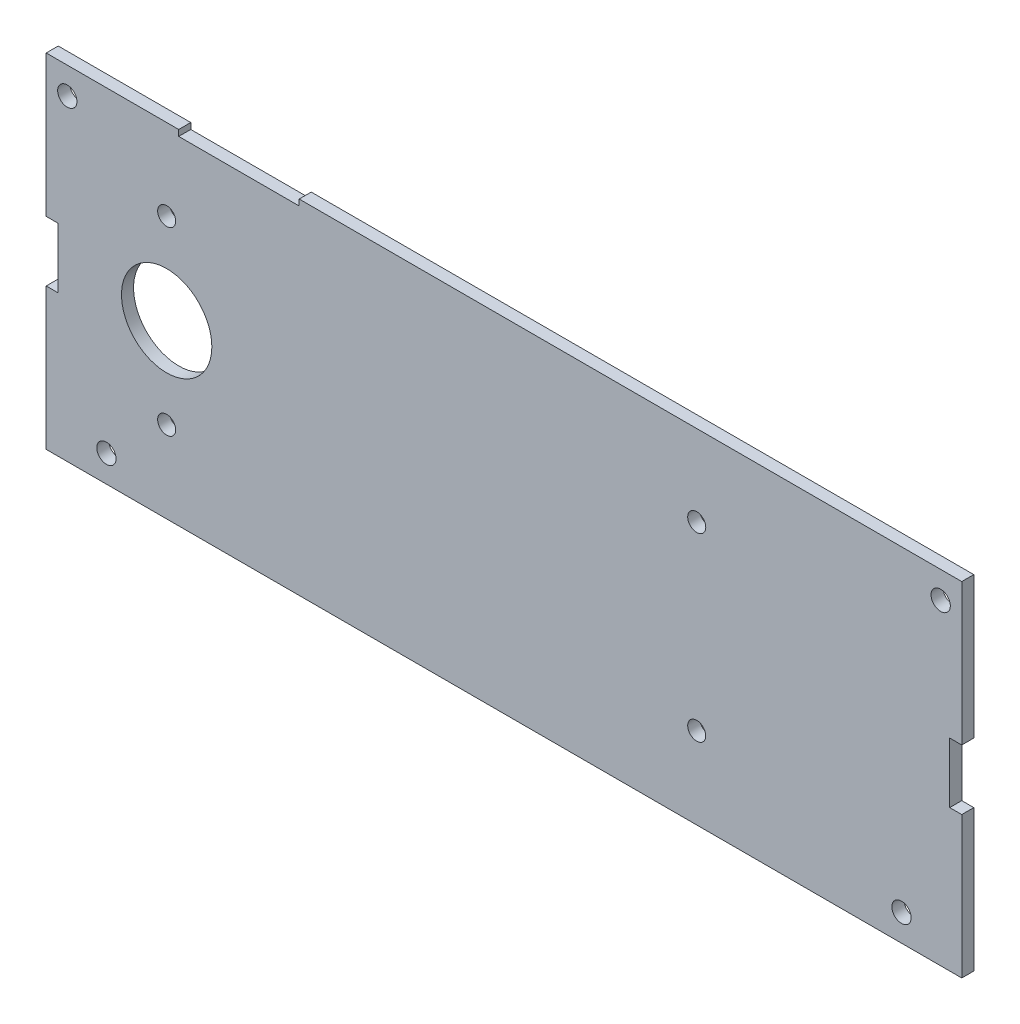
ISO-10303-21;
HEADER;
FILE_DESCRIPTION(('STEP AP214'),'2;1');
FILE_NAME('part.step','',(''),(''),'','','');
FILE_SCHEMA(('AUTOMOTIVE_DESIGN { 1 0 10303 214 1 1 1 1 }'));
ENDSEC;
DATA;
#1=APPLICATION_CONTEXT('core data for automotive mechanical design processes');
#2=APPLICATION_PROTOCOL_DEFINITION('international standard','automotive_design',2000,#1);
#3=PRODUCT_CONTEXT('',#1,'mechanical');
#4=PRODUCT('Part','Part','',(#3));
#5=PRODUCT_RELATED_PRODUCT_CATEGORY('part','',(#4));
#6=PRODUCT_DEFINITION_FORMATION('','',#4);
#7=PRODUCT_DEFINITION_CONTEXT('part definition',#1,'design');
#8=PRODUCT_DEFINITION('design','',#6,#7);
#9=PRODUCT_DEFINITION_SHAPE('','',#8);
#10=(LENGTH_UNIT() NAMED_UNIT(*) SI_UNIT(.MILLI.,.METRE.));
#11=(NAMED_UNIT(*) PLANE_ANGLE_UNIT() SI_UNIT($,.RADIAN.));
#12=(NAMED_UNIT(*) SI_UNIT($,.STERADIAN.) SOLID_ANGLE_UNIT());
#13=UNCERTAINTY_MEASURE_WITH_UNIT(LENGTH_MEASURE(1.E-05),#10,'distance_accuracy_value','');
#14=(GEOMETRIC_REPRESENTATION_CONTEXT(3) GLOBAL_UNCERTAINTY_ASSIGNED_CONTEXT((#13)) GLOBAL_UNIT_ASSIGNED_CONTEXT((#10,
#11,#12)) REPRESENTATION_CONTEXT('',''));
#15=CARTESIAN_POINT('',(0.,0.,0.));
#16=DIRECTION('',(0.,0.,1.));
#17=DIRECTION('',(1.,0.,0.));
#18=AXIS2_PLACEMENT_3D('',#15,#16,#17);
#19=CARTESIAN_POINT('',(0.,28.5,2.));
#20=DIRECTION('',(0.,1.,0.));
#21=DIRECTION('',(0.,0.,1.));
#22=AXIS2_PLACEMENT_3D('',#19,#20,#21);
#23=PLANE('',#22);
#24=DIRECTION('',(1.,0.,0.));
#25=VECTOR('',#24,1.);
#26=CARTESIAN_POINT('',(0.,28.5,0.));
#27=LINE('',#26,#25);
#28=CARTESIAN_POINT('',(-34.,28.5,0.));
#29=VERTEX_POINT('',#28);
#30=CARTESIAN_POINT('',(76.,28.5,0.));
#31=VERTEX_POINT('',#30);
#32=EDGE_CURVE('E334',#29,#31,#27,.T.);
#33=ORIENTED_EDGE('',*,*,#32,.F.);
#34=DIRECTION('',(0.,0.,1.));
#35=VECTOR('',#34,1.);
#36=CARTESIAN_POINT('',(-34.,28.5,0.));
#37=LINE('',#36,#35);
#38=CARTESIAN_POINT('',(-34.,28.5,2.));
#39=VERTEX_POINT('',#38);
#40=EDGE_CURVE('E50',#29,#39,#37,.T.);
#41=ORIENTED_EDGE('',*,*,#40,.T.);
#42=DIRECTION('',(1.,0.,0.));
#43=VECTOR('',#42,1.);
#44=CARTESIAN_POINT('',(0.,28.5,2.));
#45=LINE('',#44,#43);
#46=CARTESIAN_POINT('',(76.,28.5,2.));
#47=VERTEX_POINT('',#46);
#48=EDGE_CURVE('E167',#39,#47,#45,.T.);
#49=ORIENTED_EDGE('',*,*,#48,.T.);
#50=DIRECTION('',(0.,0.,-1.));
#51=VECTOR('',#50,1.);
#52=CARTESIAN_POINT('',(76.,28.5,2.));
#53=LINE('',#52,#51);
#54=EDGE_CURVE('E294',#47,#31,#53,.T.);
#55=ORIENTED_EDGE('',*,*,#54,.T.);
#56=EDGE_LOOP('',(#33,#41,#49,#55));
#57=FACE_BOUND('',#56,.T.);
#58=ADVANCED_FACE('F35',(#57),#23,.T.);
#59=CARTESIAN_POINT('',(0.,0.,2.));
#60=DIRECTION('',(0.,0.,1.));
#61=DIRECTION('',(1.,0.,0.));
#62=AXIS2_PLACEMENT_3D('',#59,#60,#61);
#63=PLANE('',#62);
#64=CARTESIAN_POINT('',(32.,15.05,2.));
#65=DIRECTION('',(0.,0.,1.));
#66=DIRECTION('',(1.,0.,0.));
#67=AXIS2_PLACEMENT_3D('',#64,#65,#66);
#68=CIRCLE('',#67,1.5);
#69=CARTESIAN_POINT('',(33.5,15.05,2.));
#70=VERTEX_POINT('',#69);
#71=EDGE_CURVE('E255',#70,#70,#68,.T.);
#72=ORIENTED_EDGE('',*,*,#71,.F.);
#73=EDGE_LOOP('',(#72));
#74=FACE_BOUND('',#73,.T.);
#75=CARTESIAN_POINT('',(-56.,-14.95,2.));
#76=DIRECTION('',(0.,0.,1.));
#77=DIRECTION('',(1.,0.,0.));
#78=AXIS2_PLACEMENT_3D('',#75,#76,#77);
#79=CIRCLE('',#78,1.5);
#80=CARTESIAN_POINT('',(-54.5,-14.95,2.));
#81=VERTEX_POINT('',#80);
#82=EDGE_CURVE('E252',#81,#81,#79,.T.);
#83=ORIENTED_EDGE('',*,*,#82,.F.);
#84=EDGE_LOOP('',(#83));
#85=FACE_BOUND('',#84,.T.);
#86=CARTESIAN_POINT('',(-56.,0.,2.));
#87=DIRECTION('',(0.,0.,1.));
#88=DIRECTION('',(1.,0.,0.));
#89=AXIS2_PLACEMENT_3D('',#86,#87,#88);
#90=CIRCLE('',#89,7.5);
#91=CARTESIAN_POINT('',(-48.5,0.,2.));
#92=VERTEX_POINT('',#91);
#93=EDGE_CURVE('E179',#92,#92,#90,.T.);
#94=ORIENTED_EDGE('',*,*,#93,.F.);
#95=EDGE_LOOP('',(#94));
#96=FACE_BOUND('',#95,.T.);
#97=CARTESIAN_POINT('',(-66.,-24.05,2.));
#98=DIRECTION('',(0.,0.,1.));
#99=DIRECTION('',(1.,0.,0.));
#100=AXIS2_PLACEMENT_3D('',#97,#98,#99);
#101=CIRCLE('',#100,1.6);
#102=CARTESIAN_POINT('',(-64.4,-24.05,2.));
#103=VERTEX_POINT('',#102);
#104=EDGE_CURVE('E214',#103,#103,#101,.T.);
#105=ORIENTED_EDGE('',*,*,#104,.F.);
#106=EDGE_LOOP('',(#105));
#107=FACE_BOUND('',#106,.T.);
#108=CARTESIAN_POINT('',(66.,-24.05,2.));
#109=DIRECTION('',(0.,0.,1.));
#110=DIRECTION('',(1.,0.,0.));
#111=AXIS2_PLACEMENT_3D('',#108,#109,#110);
#112=CIRCLE('',#111,1.6);
#113=CARTESIAN_POINT('',(67.6,-24.05,2.));
#114=VERTEX_POINT('',#113);
#115=EDGE_CURVE('E208',#114,#114,#112,.T.);
#116=ORIENTED_EDGE('',*,*,#115,.F.);
#117=EDGE_LOOP('',(#116));
#118=FACE_BOUND('',#117,.T.);
#119=CARTESIAN_POINT('',(72.5,24.05,2.));
#120=DIRECTION('',(0.,0.,1.));
#121=DIRECTION('',(1.,0.,0.));
#122=AXIS2_PLACEMENT_3D('',#119,#120,#121);
#123=CIRCLE('',#122,1.6);
#124=CARTESIAN_POINT('',(74.1,24.05,2.));
#125=VERTEX_POINT('',#124);
#126=EDGE_CURVE('E202',#125,#125,#123,.T.);
#127=ORIENTED_EDGE('',*,*,#126,.F.);
#128=EDGE_LOOP('',(#127));
#129=FACE_BOUND('',#128,.T.);
#130=CARTESIAN_POINT('',(-72.5,24.05,2.));
#131=DIRECTION('',(0.,0.,1.));
#132=DIRECTION('',(1.,0.,0.));
#133=AXIS2_PLACEMENT_3D('',#130,#131,#132);
#134=CIRCLE('',#133,1.6);
#135=CARTESIAN_POINT('',(-70.9,24.05,2.));
#136=VERTEX_POINT('',#135);
#137=EDGE_CURVE('E192',#136,#136,#134,.T.);
#138=ORIENTED_EDGE('',*,*,#137,.F.);
#139=EDGE_LOOP('',(#138));
#140=FACE_BOUND('',#139,.T.);
#141=CARTESIAN_POINT('',(32.,-14.95,2.));
#142=DIRECTION('',(0.,0.,1.));
#143=DIRECTION('',(1.,0.,0.));
#144=AXIS2_PLACEMENT_3D('',#141,#142,#143);
#145=CIRCLE('',#144,1.5);
#146=CARTESIAN_POINT('',(33.5,-14.95,2.));
#147=VERTEX_POINT('',#146);
#148=EDGE_CURVE('E247',#147,#147,#145,.F.);
#149=ORIENTED_EDGE('',*,*,#148,.T.);
#150=EDGE_LOOP('',(#149));
#151=FACE_BOUND('',#150,.T.);
#152=CARTESIAN_POINT('',(-56.,15.05,2.));
#153=DIRECTION('',(0.,0.,1.));
#154=DIRECTION('',(1.,0.,0.));
#155=AXIS2_PLACEMENT_3D('',#152,#153,#154);
#156=CIRCLE('',#155,1.5);
#157=CARTESIAN_POINT('',(-54.5,15.05,2.));
#158=VERTEX_POINT('',#157);
#159=EDGE_CURVE('E250',#158,#158,#156,.F.);
#160=ORIENTED_EDGE('',*,*,#159,.T.);
#161=EDGE_LOOP('',(#160));
#162=FACE_BOUND('',#161,.T.);
#163=DIRECTION('',(0.,-1.,0.));
#164=VECTOR('',#163,1.);
#165=CARTESIAN_POINT('',(-53.9999999999998,-3.74700270810989E-13,2.));
#166=LINE('',#165,#164);
#167=CARTESIAN_POINT('',(-54.,28.5,2.));
#168=VERTEX_POINT('',#167);
#169=CARTESIAN_POINT('',(-54.,27.5,2.));
#170=VERTEX_POINT('',#169);
#171=EDGE_CURVE('E266',#168,#170,#166,.T.);
#172=ORIENTED_EDGE('',*,*,#171,.F.);
#173=CARTESIAN_POINT('',(-76.,28.5,2.));
#174=VERTEX_POINT('',#173);
#175=EDGE_CURVE('E172',#174,#168,#45,.T.);
#176=ORIENTED_EDGE('',*,*,#175,.F.);
#177=DIRECTION('',(0.,-1.,0.));
#178=VECTOR('',#177,1.);
#179=CARTESIAN_POINT('',(-76.,0.,2.));
#180=LINE('',#179,#178);
#181=CARTESIAN_POINT('',(-76.,5.,2.));
#182=VERTEX_POINT('',#181);
#183=EDGE_CURVE('E350',#174,#182,#180,.T.);
#184=ORIENTED_EDGE('',*,*,#183,.T.);
#185=DIRECTION('',(-1.,0.,0.));
#186=VECTOR('',#185,1.);
#187=CARTESIAN_POINT('',(0.,5.00000000000001,2.));
#188=LINE('',#187,#186);
#189=CARTESIAN_POINT('',(-74.,5.,2.));
#190=VERTEX_POINT('',#189);
#191=EDGE_CURVE('E347',#190,#182,#188,.T.);
#192=ORIENTED_EDGE('',*,*,#191,.F.);
#193=DIRECTION('',(0.,-1.,0.));
#194=VECTOR('',#193,1.);
#195=CARTESIAN_POINT('',(-74.,0.,2.));
#196=LINE('',#195,#194);
#197=CARTESIAN_POINT('',(-74.,-5.,2.));
#198=VERTEX_POINT('',#197);
#199=EDGE_CURVE('E345',#190,#198,#196,.T.);
#200=ORIENTED_EDGE('',*,*,#199,.T.);
#201=DIRECTION('',(-1.,0.,0.));
#202=VECTOR('',#201,1.);
#203=CARTESIAN_POINT('',(0.,-4.99999999999997,2.));
#204=LINE('',#203,#202);
#205=CARTESIAN_POINT('',(-76.,-5.,2.));
#206=VERTEX_POINT('',#205);
#207=EDGE_CURVE('E342',#198,#206,#204,.T.);
#208=ORIENTED_EDGE('',*,*,#207,.T.);
#209=CARTESIAN_POINT('',(-76.,-28.5,2.));
#210=VERTEX_POINT('',#209);
#211=EDGE_CURVE('E144',#206,#210,#180,.T.);
#212=ORIENTED_EDGE('',*,*,#211,.T.);
#213=DIRECTION('',(1.,0.,0.));
#214=VECTOR('',#213,1.);
#215=CARTESIAN_POINT('',(0.,-28.5,2.));
#216=LINE('',#215,#214);
#217=CARTESIAN_POINT('',(76.,-28.5,2.));
#218=VERTEX_POINT('',#217);
#219=EDGE_CURVE('E136',#210,#218,#216,.T.);
#220=ORIENTED_EDGE('',*,*,#219,.T.);
#221=DIRECTION('',(0.,-1.,0.));
#222=VECTOR('',#221,1.);
#223=CARTESIAN_POINT('',(76.,0.,2.));
#224=LINE('',#223,#222);
#225=CARTESIAN_POINT('',(76.,-5.,2.));
#226=VERTEX_POINT('',#225);
#227=EDGE_CURVE('E142',#226,#218,#224,.T.);
#228=ORIENTED_EDGE('',*,*,#227,.F.);
#229=DIRECTION('',(1.,0.,0.));
#230=VECTOR('',#229,1.);
#231=CARTESIAN_POINT('',(0.,-4.99999999999997,2.));
#232=LINE('',#231,#230);
#233=CARTESIAN_POINT('',(74.,-5.,2.));
#234=VERTEX_POINT('',#233);
#235=EDGE_CURVE('E160',#234,#226,#232,.T.);
#236=ORIENTED_EDGE('',*,*,#235,.F.);
#237=DIRECTION('',(0.,-1.,0.));
#238=VECTOR('',#237,1.);
#239=CARTESIAN_POINT('',(74.,0.,2.));
#240=LINE('',#239,#238);
#241=CARTESIAN_POINT('',(74.,5.,2.));
#242=VERTEX_POINT('',#241);
#243=EDGE_CURVE('E173',#242,#234,#240,.T.);
#244=ORIENTED_EDGE('',*,*,#243,.F.);
#245=DIRECTION('',(1.,0.,0.));
#246=VECTOR('',#245,1.);
#247=CARTESIAN_POINT('',(0.,5.00000000000001,2.));
#248=LINE('',#247,#246);
#249=CARTESIAN_POINT('',(76.,5.,2.));
#250=VERTEX_POINT('',#249);
#251=EDGE_CURVE('E168',#242,#250,#248,.T.);
#252=ORIENTED_EDGE('',*,*,#251,.T.);
#253=EDGE_CURVE('E162',#47,#250,#224,.T.);
#254=ORIENTED_EDGE('',*,*,#253,.F.);
#255=ORIENTED_EDGE('',*,*,#48,.F.);
#256=DIRECTION('',(0.,-1.,0.));
#257=VECTOR('',#256,1.);
#258=CARTESIAN_POINT('',(-34.,0.,2.));
#259=LINE('',#258,#257);
#260=CARTESIAN_POINT('',(-34.,27.5,2.));
#261=VERTEX_POINT('',#260);
#262=EDGE_CURVE('E263',#39,#261,#259,.T.);
#263=ORIENTED_EDGE('',*,*,#262,.T.);
#264=DIRECTION('',(1.,0.,0.));
#265=VECTOR('',#264,1.);
#266=CARTESIAN_POINT('',(0.,27.5,2.));
#267=LINE('',#266,#265);
#268=EDGE_CURVE('E184',#170,#261,#267,.T.);
#269=ORIENTED_EDGE('',*,*,#268,.F.);
#270=EDGE_LOOP('',(#172,#176,#184,#192,#200,#208,#212,#220,#228,#236,#244,#252,#254,#255,#263,#269));
#271=FACE_BOUND('',#270,.T.);
#272=ADVANCED_FACE('F139',(#74,#85,#96,#107,#118,#129,#140,#151,#162,#271),#63,.T.);
#273=CARTESIAN_POINT('',(0.,0.,0.));
#274=DIRECTION('',(0.,0.,1.));
#275=DIRECTION('',(1.,0.,0.));
#276=AXIS2_PLACEMENT_3D('',#273,#274,#275);
#277=PLANE('',#276);
#278=CARTESIAN_POINT('',(-56.,-14.95,0.));
#279=DIRECTION('',(0.,0.,1.));
#280=DIRECTION('',(1.,0.,0.));
#281=AXIS2_PLACEMENT_3D('',#278,#279,#280);
#282=CIRCLE('',#281,1.5);
#283=CARTESIAN_POINT('',(-54.5,-14.95,0.));
#284=VERTEX_POINT('',#283);
#285=EDGE_CURVE('E381',#284,#284,#282,.T.);
#286=ORIENTED_EDGE('',*,*,#285,.T.);
#287=EDGE_LOOP('',(#286));
#288=FACE_BOUND('',#287,.T.);
#289=CARTESIAN_POINT('',(-56.,15.05,0.));
#290=DIRECTION('',(0.,0.,-1.));
#291=DIRECTION('',(-1.,0.,0.));
#292=AXIS2_PLACEMENT_3D('',#289,#290,#291);
#293=CIRCLE('',#292,1.5);
#294=CARTESIAN_POINT('',(-57.5,15.05,0.));
#295=VERTEX_POINT('',#294);
#296=EDGE_CURVE('E377',#295,#295,#293,.T.);
#297=ORIENTED_EDGE('',*,*,#296,.F.);
#298=EDGE_LOOP('',(#297));
#299=FACE_BOUND('',#298,.T.);
#300=CARTESIAN_POINT('',(32.,-14.95,0.));
#301=DIRECTION('',(0.,0.,1.));
#302=DIRECTION('',(1.,0.,0.));
#303=AXIS2_PLACEMENT_3D('',#300,#301,#302);
#304=CIRCLE('',#303,1.5);
#305=CARTESIAN_POINT('',(33.5,-14.95,0.));
#306=VERTEX_POINT('',#305);
#307=EDGE_CURVE('E257',#306,#306,#304,.F.);
#308=ORIENTED_EDGE('',*,*,#307,.F.);
#309=EDGE_LOOP('',(#308));
#310=FACE_BOUND('',#309,.T.);
#311=CARTESIAN_POINT('',(-72.5,24.05,0.));
#312=DIRECTION('',(0.,0.,1.));
#313=DIRECTION('',(1.,0.,0.));
#314=AXIS2_PLACEMENT_3D('',#311,#312,#313);
#315=CIRCLE('',#314,1.6);
#316=CARTESIAN_POINT('',(-70.9,24.05,0.));
#317=VERTEX_POINT('',#316);
#318=EDGE_CURVE('E197',#317,#317,#315,.T.);
#319=ORIENTED_EDGE('',*,*,#318,.T.);
#320=EDGE_LOOP('',(#319));
#321=FACE_BOUND('',#320,.T.);
#322=CARTESIAN_POINT('',(72.5,24.05,0.));
#323=DIRECTION('',(0.,0.,1.));
#324=DIRECTION('',(1.,0.,0.));
#325=AXIS2_PLACEMENT_3D('',#322,#323,#324);
#326=CIRCLE('',#325,1.6);
#327=CARTESIAN_POINT('',(74.1,24.05,0.));
#328=VERTEX_POINT('',#327);
#329=EDGE_CURVE('E198',#328,#328,#326,.T.);
#330=ORIENTED_EDGE('',*,*,#329,.T.);
#331=EDGE_LOOP('',(#330));
#332=FACE_BOUND('',#331,.T.);
#333=CARTESIAN_POINT('',(66.,-24.05,0.));
#334=DIRECTION('',(0.,0.,1.));
#335=DIRECTION('',(1.,0.,0.));
#336=AXIS2_PLACEMENT_3D('',#333,#334,#335);
#337=CIRCLE('',#336,1.6);
#338=CARTESIAN_POINT('',(67.6,-24.05,0.));
#339=VERTEX_POINT('',#338);
#340=EDGE_CURVE('E206',#339,#339,#337,.T.);
#341=ORIENTED_EDGE('',*,*,#340,.T.);
#342=EDGE_LOOP('',(#341));
#343=FACE_BOUND('',#342,.T.);
#344=CARTESIAN_POINT('',(-66.,-24.05,0.));
#345=DIRECTION('',(0.,0.,1.));
#346=DIRECTION('',(1.,0.,0.));
#347=AXIS2_PLACEMENT_3D('',#344,#345,#346);
#348=CIRCLE('',#347,1.6);
#349=CARTESIAN_POINT('',(-64.4,-24.05,0.));
#350=VERTEX_POINT('',#349);
#351=EDGE_CURVE('E212',#350,#350,#348,.T.);
#352=ORIENTED_EDGE('',*,*,#351,.T.);
#353=EDGE_LOOP('',(#352));
#354=FACE_BOUND('',#353,.T.);
#355=CARTESIAN_POINT('',(-56.,0.,0.));
#356=DIRECTION('',(0.,0.,1.));
#357=DIRECTION('',(1.,0.,0.));
#358=AXIS2_PLACEMENT_3D('',#355,#356,#357);
#359=CIRCLE('',#358,7.5);
#360=CARTESIAN_POINT('',(-48.5,0.,0.));
#361=VERTEX_POINT('',#360);
#362=EDGE_CURVE('E183',#361,#361,#359,.T.);
#363=ORIENTED_EDGE('',*,*,#362,.T.);
#364=EDGE_LOOP('',(#363));
#365=FACE_BOUND('',#364,.T.);
#366=CARTESIAN_POINT('',(32.,15.05,0.));
#367=DIRECTION('',(0.,0.,1.));
#368=DIRECTION('',(1.,0.,0.));
#369=AXIS2_PLACEMENT_3D('',#366,#367,#368);
#370=CIRCLE('',#369,1.5);
#371=CARTESIAN_POINT('',(33.5,15.05,0.));
#372=VERTEX_POINT('',#371);
#373=EDGE_CURVE('E375',#372,#372,#370,.T.);
#374=ORIENTED_EDGE('',*,*,#373,.T.);
#375=EDGE_LOOP('',(#374));
#376=FACE_BOUND('',#375,.T.);
#377=CARTESIAN_POINT('',(-76.,28.5,0.));
#378=VERTEX_POINT('',#377);
#379=CARTESIAN_POINT('',(-54.,28.5,0.));
#380=VERTEX_POINT('',#379);
#381=EDGE_CURVE('E331',#378,#380,#27,.T.);
#382=ORIENTED_EDGE('',*,*,#381,.T.);
#383=DIRECTION('',(0.,-1.,0.));
#384=VECTOR('',#383,1.);
#385=CARTESIAN_POINT('',(-54.,28.5,0.));
#386=LINE('',#385,#384);
#387=CARTESIAN_POINT('',(-54.,27.5,0.));
#388=VERTEX_POINT('',#387);
#389=EDGE_CURVE('E287',#380,#388,#386,.T.);
#390=ORIENTED_EDGE('',*,*,#389,.T.);
#391=DIRECTION('',(1.,0.,0.));
#392=VECTOR('',#391,1.);
#393=CARTESIAN_POINT('',(-54.,27.5,0.));
#394=LINE('',#393,#392);
#395=CARTESIAN_POINT('',(-34.,27.5,0.));
#396=VERTEX_POINT('',#395);
#397=EDGE_CURVE('E374',#388,#396,#394,.T.);
#398=ORIENTED_EDGE('',*,*,#397,.T.);
#399=DIRECTION('',(0.,-1.,0.));
#400=VECTOR('',#399,1.);
#401=CARTESIAN_POINT('',(-34.,28.5,0.));
#402=LINE('',#401,#400);
#403=EDGE_CURVE('E286',#29,#396,#402,.T.);
#404=ORIENTED_EDGE('',*,*,#403,.F.);
#405=ORIENTED_EDGE('',*,*,#32,.T.);
#406=DIRECTION('',(0.,-1.,0.));
#407=VECTOR('',#406,1.);
#408=CARTESIAN_POINT('',(76.,0.,0.));
#409=LINE('',#408,#407);
#410=CARTESIAN_POINT('',(76.,5.,0.));
#411=VERTEX_POINT('',#410);
#412=EDGE_CURVE('E298',#31,#411,#409,.T.);
#413=ORIENTED_EDGE('',*,*,#412,.T.);
#414=DIRECTION('',(1.,0.,0.));
#415=VECTOR('',#414,1.);
#416=CARTESIAN_POINT('',(0.,5.00000000000001,0.));
#417=LINE('',#416,#415);
#418=CARTESIAN_POINT('',(74.,5.,0.));
#419=VERTEX_POINT('',#418);
#420=EDGE_CURVE('E336',#419,#411,#417,.T.);
#421=ORIENTED_EDGE('',*,*,#420,.F.);
#422=DIRECTION('',(0.,-1.,0.));
#423=VECTOR('',#422,1.);
#424=CARTESIAN_POINT('',(74.,0.,0.));
#425=LINE('',#424,#423);
#426=CARTESIAN_POINT('',(74.,-5.,0.));
#427=VERTEX_POINT('',#426);
#428=EDGE_CURVE('E339',#419,#427,#425,.T.);
#429=ORIENTED_EDGE('',*,*,#428,.T.);
#430=DIRECTION('',(1.,0.,0.));
#431=VECTOR('',#430,1.);
#432=CARTESIAN_POINT('',(0.,-4.99999999999997,0.));
#433=LINE('',#432,#431);
#434=CARTESIAN_POINT('',(76.,-5.,0.));
#435=VERTEX_POINT('',#434);
#436=EDGE_CURVE('E176',#427,#435,#433,.T.);
#437=ORIENTED_EDGE('',*,*,#436,.T.);
#438=CARTESIAN_POINT('',(76.,-28.5,0.));
#439=VERTEX_POINT('',#438);
#440=EDGE_CURVE('E318',#435,#439,#409,.T.);
#441=ORIENTED_EDGE('',*,*,#440,.T.);
#442=DIRECTION('',(1.,0.,0.));
#443=VECTOR('',#442,1.);
#444=CARTESIAN_POINT('',(0.,-28.5,0.));
#445=LINE('',#444,#443);
#446=CARTESIAN_POINT('',(-76.,-28.5,0.));
#447=VERTEX_POINT('',#446);
#448=EDGE_CURVE('E152',#447,#439,#445,.T.);
#449=ORIENTED_EDGE('',*,*,#448,.F.);
#450=DIRECTION('',(0.,-1.,0.));
#451=VECTOR('',#450,1.);
#452=CARTESIAN_POINT('',(-76.,0.,0.));
#453=LINE('',#452,#451);
#454=CARTESIAN_POINT('',(-76.,-5.,0.));
#455=VERTEX_POINT('',#454);
#456=EDGE_CURVE('E320',#455,#447,#453,.T.);
#457=ORIENTED_EDGE('',*,*,#456,.F.);
#458=DIRECTION('',(-1.,0.,0.));
#459=VECTOR('',#458,1.);
#460=CARTESIAN_POINT('',(0.,-4.99999999999997,0.));
#461=LINE('',#460,#459);
#462=CARTESIAN_POINT('',(-74.,-5.,0.));
#463=VERTEX_POINT('',#462);
#464=EDGE_CURVE('E321',#463,#455,#461,.T.);
#465=ORIENTED_EDGE('',*,*,#464,.F.);
#466=DIRECTION('',(0.,-1.,0.));
#467=VECTOR('',#466,1.);
#468=CARTESIAN_POINT('',(-74.,0.,0.));
#469=LINE('',#468,#467);
#470=CARTESIAN_POINT('',(-74.,5.,0.));
#471=VERTEX_POINT('',#470);
#472=EDGE_CURVE('E323',#471,#463,#469,.T.);
#473=ORIENTED_EDGE('',*,*,#472,.F.);
#474=DIRECTION('',(-1.,0.,0.));
#475=VECTOR('',#474,1.);
#476=CARTESIAN_POINT('',(0.,5.00000000000001,0.));
#477=LINE('',#476,#475);
#478=CARTESIAN_POINT('',(-76.,5.,0.));
#479=VERTEX_POINT('',#478);
#480=EDGE_CURVE('E325',#471,#479,#477,.T.);
#481=ORIENTED_EDGE('',*,*,#480,.T.);
#482=EDGE_CURVE('E328',#378,#479,#453,.T.);
#483=ORIENTED_EDGE('',*,*,#482,.F.);
#484=EDGE_LOOP('',(#382,#390,#398,#404,#405,#413,#421,#429,#437,#441,#449,#457,#465,#473,#481,#483));
#485=FACE_BOUND('',#484,.T.);
#486=ADVANCED_FACE('F222',(#288,#299,#310,#321,#332,#343,#354,#365,#376,#485),#277,.F.);
#487=CARTESIAN_POINT('',(74.,0.,2.));
#488=DIRECTION('',(1.,0.,0.));
#489=DIRECTION('',(0.,0.,-1.));
#490=AXIS2_PLACEMENT_3D('',#487,#488,#489);
#491=PLANE('',#490);
#492=ORIENTED_EDGE('',*,*,#428,.F.);
#493=DIRECTION('',(0.,0.,-1.));
#494=VECTOR('',#493,1.);
#495=CARTESIAN_POINT('',(74.,5.,2.));
#496=LINE('',#495,#494);
#497=EDGE_CURVE('E12',#242,#419,#496,.T.);
#498=ORIENTED_EDGE('',*,*,#497,.F.);
#499=ORIENTED_EDGE('',*,*,#243,.T.);
#500=DIRECTION('',(0.,0.,-1.));
#501=VECTOR('',#500,1.);
#502=CARTESIAN_POINT('',(74.,-5.,2.));
#503=LINE('',#502,#501);
#504=EDGE_CURVE('E59',#234,#427,#503,.T.);
#505=ORIENTED_EDGE('',*,*,#504,.T.);
#506=EDGE_LOOP('',(#492,#498,#499,#505));
#507=FACE_BOUND('',#506,.T.);
#508=ADVANCED_FACE('F37',(#507),#491,.T.);
#509=CARTESIAN_POINT('',(0.,5.00000000000001,2.));
#510=DIRECTION('',(0.,1.,0.));
#511=DIRECTION('',(-1.,0.,0.));
#512=AXIS2_PLACEMENT_3D('',#509,#510,#511);
#513=PLANE('',#512);
#514=ORIENTED_EDGE('',*,*,#420,.T.);
#515=DIRECTION('',(0.,0.,-1.));
#516=VECTOR('',#515,1.);
#517=CARTESIAN_POINT('',(76.,5.,2.));
#518=LINE('',#517,#516);
#519=EDGE_CURVE('E43',#250,#411,#518,.T.);
#520=ORIENTED_EDGE('',*,*,#519,.F.);
#521=ORIENTED_EDGE('',*,*,#251,.F.);
#522=ORIENTED_EDGE('',*,*,#497,.T.);
#523=EDGE_LOOP('',(#514,#520,#521,#522));
#524=FACE_BOUND('',#523,.T.);
#525=ADVANCED_FACE('F420',(#524),#513,.F.);
#526=CARTESIAN_POINT('',(76.,0.,2.));
#527=DIRECTION('',(1.,0.,0.));
#528=DIRECTION('',(0.,1.,0.));
#529=AXIS2_PLACEMENT_3D('',#526,#527,#528);
#530=PLANE('',#529);
#531=ORIENTED_EDGE('',*,*,#412,.F.);
#532=ORIENTED_EDGE('',*,*,#54,.F.);
#533=ORIENTED_EDGE('',*,*,#253,.T.);
#534=ORIENTED_EDGE('',*,*,#519,.T.);
#535=EDGE_LOOP('',(#531,#532,#533,#534));
#536=FACE_BOUND('',#535,.T.);
#537=ADVANCED_FACE('F296',(#536),#530,.T.);
#538=DIRECTION('',(0.,0.,1.));
#539=VECTOR('',#538,1.);
#540=CARTESIAN_POINT('',(-54.,28.5,0.));
#541=LINE('',#540,#539);
#542=EDGE_CURVE('E359',#380,#168,#541,.T.);
#543=ORIENTED_EDGE('',*,*,#542,.F.);
#544=ORIENTED_EDGE('',*,*,#381,.F.);
#545=DIRECTION('',(0.,0.,-1.));
#546=VECTOR('',#545,1.);
#547=CARTESIAN_POINT('',(-76.,28.5,2.));
#548=LINE('',#547,#546);
#549=EDGE_CURVE('E299',#174,#378,#548,.T.);
#550=ORIENTED_EDGE('',*,*,#549,.F.);
#551=ORIENTED_EDGE('',*,*,#175,.T.);
#552=EDGE_LOOP('',(#543,#544,#550,#551));
#553=FACE_BOUND('',#552,.T.);
#554=ADVANCED_FACE('F355',(#553),#23,.T.);
#555=CARTESIAN_POINT('',(-76.,0.,2.));
#556=DIRECTION('',(1.,0.,0.));
#557=DIRECTION('',(0.,1.,0.));
#558=AXIS2_PLACEMENT_3D('',#555,#556,#557);
#559=PLANE('',#558);
#560=ORIENTED_EDGE('',*,*,#482,.T.);
#561=DIRECTION('',(0.,0.,-1.));
#562=VECTOR('',#561,1.);
#563=CARTESIAN_POINT('',(-76.,5.,2.));
#564=LINE('',#563,#562);
#565=EDGE_CURVE('E301',#182,#479,#564,.T.);
#566=ORIENTED_EDGE('',*,*,#565,.F.);
#567=ORIENTED_EDGE('',*,*,#183,.F.);
#568=ORIENTED_EDGE('',*,*,#549,.T.);
#569=EDGE_LOOP('',(#560,#566,#567,#568));
#570=FACE_BOUND('',#569,.T.);
#571=ADVANCED_FACE('F411',(#570),#559,.F.);
#572=CARTESIAN_POINT('',(0.,5.00000000000001,2.));
#573=DIRECTION('',(0.,-1.,0.));
#574=DIRECTION('',(1.,0.,0.));
#575=AXIS2_PLACEMENT_3D('',#572,#573,#574);
#576=PLANE('',#575);
#577=ORIENTED_EDGE('',*,*,#480,.F.);
#578=DIRECTION('',(0.,0.,-1.));
#579=VECTOR('',#578,1.);
#580=CARTESIAN_POINT('',(-74.,5.,2.));
#581=LINE('',#580,#579);
#582=EDGE_CURVE('E305',#190,#471,#581,.T.);
#583=ORIENTED_EDGE('',*,*,#582,.F.);
#584=ORIENTED_EDGE('',*,*,#191,.T.);
#585=ORIENTED_EDGE('',*,*,#565,.T.);
#586=EDGE_LOOP('',(#577,#583,#584,#585));
#587=FACE_BOUND('',#586,.T.);
#588=ADVANCED_FACE('F416',(#587),#576,.T.);
#589=CARTESIAN_POINT('',(-74.,0.,2.));
#590=DIRECTION('',(1.,0.,0.));
#591=DIRECTION('',(0.,0.,-1.));
#592=AXIS2_PLACEMENT_3D('',#589,#590,#591);
#593=PLANE('',#592);
#594=ORIENTED_EDGE('',*,*,#472,.T.);
#595=DIRECTION('',(0.,0.,-1.));
#596=VECTOR('',#595,1.);
#597=CARTESIAN_POINT('',(-74.,-5.,2.));
#598=LINE('',#597,#596);
#599=EDGE_CURVE('E307',#198,#463,#598,.T.);
#600=ORIENTED_EDGE('',*,*,#599,.F.);
#601=ORIENTED_EDGE('',*,*,#199,.F.);
#602=ORIENTED_EDGE('',*,*,#582,.T.);
#603=EDGE_LOOP('',(#594,#600,#601,#602));
#604=FACE_BOUND('',#603,.T.);
#605=ADVANCED_FACE('F441',(#604),#593,.F.);
#606=CARTESIAN_POINT('',(0.,-4.99999999999997,2.));
#607=DIRECTION('',(0.,-1.,0.));
#608=DIRECTION('',(1.,0.,0.));
#609=AXIS2_PLACEMENT_3D('',#606,#607,#608);
#610=PLANE('',#609);
#611=ORIENTED_EDGE('',*,*,#464,.T.);
#612=DIRECTION('',(0.,0.,-1.));
#613=VECTOR('',#612,1.);
#614=CARTESIAN_POINT('',(-76.,-5.,2.));
#615=LINE('',#614,#613);
#616=EDGE_CURVE('E310',#206,#455,#615,.T.);
#617=ORIENTED_EDGE('',*,*,#616,.F.);
#618=ORIENTED_EDGE('',*,*,#207,.F.);
#619=ORIENTED_EDGE('',*,*,#599,.T.);
#620=EDGE_LOOP('',(#611,#617,#618,#619));
#621=FACE_BOUND('',#620,.T.);
#622=ADVANCED_FACE('F436',(#621),#610,.F.);
#623=ORIENTED_EDGE('',*,*,#456,.T.);
#624=DIRECTION('',(0.,0.,-1.));
#625=VECTOR('',#624,1.);
#626=CARTESIAN_POINT('',(-76.,-28.5,2.));
#627=LINE('',#626,#625);
#628=EDGE_CURVE('E156',#210,#447,#627,.T.);
#629=ORIENTED_EDGE('',*,*,#628,.F.);
#630=ORIENTED_EDGE('',*,*,#211,.F.);
#631=ORIENTED_EDGE('',*,*,#616,.T.);
#632=EDGE_LOOP('',(#623,#629,#630,#631));
#633=FACE_BOUND('',#632,.T.);
#634=ADVANCED_FACE('F419',(#633),#559,.F.);
#635=CARTESIAN_POINT('',(0.,-28.5,2.));
#636=DIRECTION('',(0.,1.,0.));
#637=DIRECTION('',(0.,0.,1.));
#638=AXIS2_PLACEMENT_3D('',#635,#636,#637);
#639=PLANE('',#638);
#640=ORIENTED_EDGE('',*,*,#448,.T.);
#641=DIRECTION('',(0.,0.,-1.));
#642=VECTOR('',#641,1.);
#643=CARTESIAN_POINT('',(76.,-28.5,2.));
#644=LINE('',#643,#642);
#645=EDGE_CURVE('E149',#218,#439,#644,.T.);
#646=ORIENTED_EDGE('',*,*,#645,.F.);
#647=ORIENTED_EDGE('',*,*,#219,.F.);
#648=ORIENTED_EDGE('',*,*,#628,.T.);
#649=EDGE_LOOP('',(#640,#646,#647,#648));
#650=FACE_BOUND('',#649,.T.);
#651=ADVANCED_FACE('F150',(#650),#639,.F.);
#652=ORIENTED_EDGE('',*,*,#440,.F.);
#653=DIRECTION('',(0.,0.,-1.));
#654=VECTOR('',#653,1.);
#655=CARTESIAN_POINT('',(76.,-5.,2.));
#656=LINE('',#655,#654);
#657=EDGE_CURVE('E157',#226,#435,#656,.T.);
#658=ORIENTED_EDGE('',*,*,#657,.F.);
#659=ORIENTED_EDGE('',*,*,#227,.T.);
#660=ORIENTED_EDGE('',*,*,#645,.T.);
#661=EDGE_LOOP('',(#652,#658,#659,#660));
#662=FACE_BOUND('',#661,.T.);
#663=ADVANCED_FACE('F159',(#662),#530,.T.);
#664=CARTESIAN_POINT('',(0.,-4.99999999999997,2.));
#665=DIRECTION('',(0.,1.,0.));
#666=DIRECTION('',(-1.,0.,0.));
#667=AXIS2_PLACEMENT_3D('',#664,#665,#666);
#668=PLANE('',#667);
#669=ORIENTED_EDGE('',*,*,#436,.F.);
#670=ORIENTED_EDGE('',*,*,#504,.F.);
#671=ORIENTED_EDGE('',*,*,#235,.T.);
#672=ORIENTED_EDGE('',*,*,#657,.T.);
#673=EDGE_LOOP('',(#669,#670,#671,#672));
#674=FACE_BOUND('',#673,.T.);
#675=ADVANCED_FACE('F229',(#674),#668,.T.);
#676=CARTESIAN_POINT('',(-56.,0.,0.));
#677=DIRECTION('',(0.,0.,1.));
#678=DIRECTION('',(1.,0.,0.));
#679=AXIS2_PLACEMENT_3D('',#676,#677,#678);
#680=CYLINDRICAL_SURFACE('',#679,7.5);
#681=ORIENTED_EDGE('',*,*,#362,.F.);
#682=EDGE_LOOP('',(#681));
#683=FACE_BOUND('',#682,.T.);
#684=ORIENTED_EDGE('',*,*,#93,.T.);
#685=EDGE_LOOP('',(#684));
#686=FACE_BOUND('',#685,.T.);
#687=ADVANCED_FACE('F225',(#683,#686),#680,.F.);
#688=CARTESIAN_POINT('',(-66.,-24.05,0.));
#689=DIRECTION('',(0.,0.,1.));
#690=DIRECTION('',(1.,0.,0.));
#691=AXIS2_PLACEMENT_3D('',#688,#689,#690);
#692=CYLINDRICAL_SURFACE('',#691,1.6);
#693=ORIENTED_EDGE('',*,*,#351,.F.);
#694=EDGE_LOOP('',(#693));
#695=FACE_BOUND('',#694,.T.);
#696=ORIENTED_EDGE('',*,*,#104,.T.);
#697=EDGE_LOOP('',(#696));
#698=FACE_BOUND('',#697,.T.);
#699=ADVANCED_FACE('F228',(#695,#698),#692,.F.);
#700=CARTESIAN_POINT('',(66.,-24.05,0.));
#701=DIRECTION('',(0.,0.,1.));
#702=DIRECTION('',(1.,0.,0.));
#703=AXIS2_PLACEMENT_3D('',#700,#701,#702);
#704=CYLINDRICAL_SURFACE('',#703,1.6);
#705=ORIENTED_EDGE('',*,*,#340,.F.);
#706=EDGE_LOOP('',(#705));
#707=FACE_BOUND('',#706,.T.);
#708=ORIENTED_EDGE('',*,*,#115,.T.);
#709=EDGE_LOOP('',(#708));
#710=FACE_BOUND('',#709,.T.);
#711=ADVANCED_FACE('F471',(#707,#710),#704,.F.);
#712=CARTESIAN_POINT('',(72.5,24.05,0.));
#713=DIRECTION('',(0.,0.,1.));
#714=DIRECTION('',(1.,0.,0.));
#715=AXIS2_PLACEMENT_3D('',#712,#713,#714);
#716=CYLINDRICAL_SURFACE('',#715,1.6);
#717=ORIENTED_EDGE('',*,*,#329,.F.);
#718=EDGE_LOOP('',(#717));
#719=FACE_BOUND('',#718,.T.);
#720=ORIENTED_EDGE('',*,*,#126,.T.);
#721=EDGE_LOOP('',(#720));
#722=FACE_BOUND('',#721,.T.);
#723=ADVANCED_FACE('F475',(#719,#722),#716,.F.);
#724=CARTESIAN_POINT('',(-72.5,24.05,0.));
#725=DIRECTION('',(0.,0.,1.));
#726=DIRECTION('',(1.,0.,0.));
#727=AXIS2_PLACEMENT_3D('',#724,#725,#726);
#728=CYLINDRICAL_SURFACE('',#727,1.6);
#729=ORIENTED_EDGE('',*,*,#318,.F.);
#730=EDGE_LOOP('',(#729));
#731=FACE_BOUND('',#730,.T.);
#732=ORIENTED_EDGE('',*,*,#137,.T.);
#733=EDGE_LOOP('',(#732));
#734=FACE_BOUND('',#733,.T.);
#735=ADVANCED_FACE('F479',(#731,#734),#728,.F.);
#736=CARTESIAN_POINT('',(32.,-14.95,0.));
#737=DIRECTION('',(0.,0.,1.));
#738=DIRECTION('',(1.,0.,0.));
#739=AXIS2_PLACEMENT_3D('',#736,#737,#738);
#740=CYLINDRICAL_SURFACE('',#739,1.5);
#741=ORIENTED_EDGE('',*,*,#148,.F.);
#742=EDGE_LOOP('',(#741));
#743=FACE_BOUND('',#742,.T.);
#744=ORIENTED_EDGE('',*,*,#307,.T.);
#745=EDGE_LOOP('',(#744));
#746=FACE_BOUND('',#745,.T.);
#747=ADVANCED_FACE('F483',(#743,#746),#740,.F.);
#748=CARTESIAN_POINT('',(-56.,15.05,0.));
#749=DIRECTION('',(0.,0.,1.));
#750=DIRECTION('',(1.,0.,0.));
#751=AXIS2_PLACEMENT_3D('',#748,#749,#750);
#752=CYLINDRICAL_SURFACE('',#751,1.5);
#753=ORIENTED_EDGE('',*,*,#159,.F.);
#754=EDGE_LOOP('',(#753));
#755=FACE_BOUND('',#754,.T.);
#756=ORIENTED_EDGE('',*,*,#296,.T.);
#757=EDGE_LOOP('',(#756));
#758=FACE_BOUND('',#757,.T.);
#759=ADVANCED_FACE('F402',(#755,#758),#752,.F.);
#760=CARTESIAN_POINT('',(-56.,-14.95,0.));
#761=DIRECTION('',(0.,0.,1.));
#762=DIRECTION('',(1.,0.,0.));
#763=AXIS2_PLACEMENT_3D('',#760,#761,#762);
#764=CYLINDRICAL_SURFACE('',#763,1.5);
#765=ORIENTED_EDGE('',*,*,#82,.T.);
#766=EDGE_LOOP('',(#765));
#767=FACE_BOUND('',#766,.T.);
#768=ORIENTED_EDGE('',*,*,#285,.F.);
#769=EDGE_LOOP('',(#768));
#770=FACE_BOUND('',#769,.T.);
#771=ADVANCED_FACE('F394',(#767,#770),#764,.F.);
#772=CARTESIAN_POINT('',(32.,15.05,0.));
#773=DIRECTION('',(0.,0.,1.));
#774=DIRECTION('',(1.,0.,0.));
#775=AXIS2_PLACEMENT_3D('',#772,#773,#774);
#776=CYLINDRICAL_SURFACE('',#775,1.5);
#777=ORIENTED_EDGE('',*,*,#71,.T.);
#778=EDGE_LOOP('',(#777));
#779=FACE_BOUND('',#778,.T.);
#780=ORIENTED_EDGE('',*,*,#373,.F.);
#781=EDGE_LOOP('',(#780));
#782=FACE_BOUND('',#781,.T.);
#783=ADVANCED_FACE('F392',(#779,#782),#776,.F.);
#784=CARTESIAN_POINT('',(-54.,27.5,0.));
#785=DIRECTION('',(0.,-1.,0.));
#786=DIRECTION('',(0.,0.,-1.));
#787=AXIS2_PLACEMENT_3D('',#784,#785,#786);
#788=PLANE('',#787);
#789=ORIENTED_EDGE('',*,*,#268,.T.);
#790=DIRECTION('',(0.,0.,1.));
#791=VECTOR('',#790,1.);
#792=CARTESIAN_POINT('',(-34.,27.5,0.));
#793=LINE('',#792,#791);
#794=EDGE_CURVE('E278',#396,#261,#793,.T.);
#795=ORIENTED_EDGE('',*,*,#794,.F.);
#796=ORIENTED_EDGE('',*,*,#397,.F.);
#797=DIRECTION('',(0.,0.,1.));
#798=VECTOR('',#797,1.);
#799=CARTESIAN_POINT('',(-54.,27.5,0.));
#800=LINE('',#799,#798);
#801=EDGE_CURVE('E281',#388,#170,#800,.T.);
#802=ORIENTED_EDGE('',*,*,#801,.T.);
#803=EDGE_LOOP('',(#789,#795,#796,#802));
#804=FACE_BOUND('',#803,.T.);
#805=ADVANCED_FACE('F275',(#804),#788,.F.);
#806=CARTESIAN_POINT('',(-54.,28.5,0.));
#807=DIRECTION('',(-1.,0.,0.));
#808=DIRECTION('',(0.,-1.,0.));
#809=AXIS2_PLACEMENT_3D('',#806,#807,#808);
#810=PLANE('',#809);
#811=ORIENTED_EDGE('',*,*,#171,.T.);
#812=ORIENTED_EDGE('',*,*,#801,.F.);
#813=ORIENTED_EDGE('',*,*,#389,.F.);
#814=ORIENTED_EDGE('',*,*,#542,.T.);
#815=EDGE_LOOP('',(#811,#812,#813,#814));
#816=FACE_BOUND('',#815,.T.);
#817=ADVANCED_FACE('F364',(#816),#810,.F.);
#818=CARTESIAN_POINT('',(-34.,28.5,0.));
#819=DIRECTION('',(-1.,0.,0.));
#820=DIRECTION('',(0.,0.,1.));
#821=AXIS2_PLACEMENT_3D('',#818,#819,#820);
#822=PLANE('',#821);
#823=ORIENTED_EDGE('',*,*,#40,.F.);
#824=ORIENTED_EDGE('',*,*,#403,.T.);
#825=ORIENTED_EDGE('',*,*,#794,.T.);
#826=ORIENTED_EDGE('',*,*,#262,.F.);
#827=EDGE_LOOP('',(#823,#824,#825,#826));
#828=FACE_BOUND('',#827,.T.);
#829=ADVANCED_FACE('F285',(#828),#822,.T.);
#830=CLOSED_SHELL('',(#58,#272,#486,#508,#525,#537,#554,#571,#588,#605,#622,#634,#651,#663,#675,
#687,#699,#711,#723,#735,#747,#759,#771,#783,#805,#817,#829));
#831=MANIFOLD_SOLID_BREP('B2',#830);
#832=ADVANCED_BREP_SHAPE_REPRESENTATION('',(#18,#831),#14);
#833=SHAPE_DEFINITION_REPRESENTATION(#9,#832);
ENDSEC;
END-ISO-10303-21;
